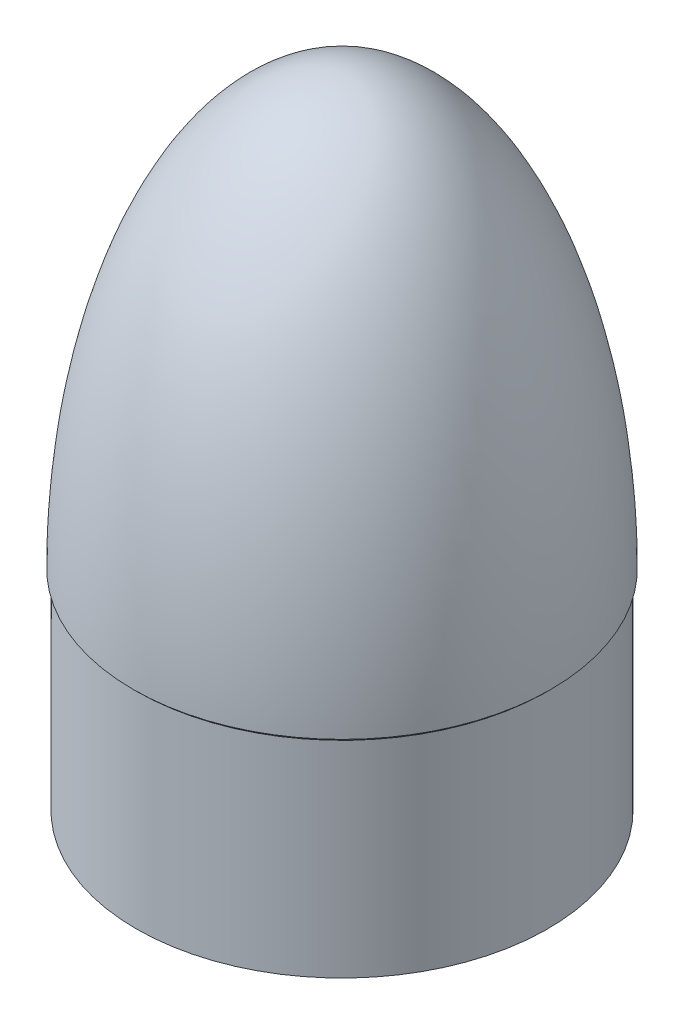
ISO-10303-21;
HEADER;
FILE_DESCRIPTION(('STEP AP214'),'2;1');
FILE_NAME('part.step','',(''),(''),'','','');
FILE_SCHEMA(('AUTOMOTIVE_DESIGN { 1 0 10303 214 1 1 1 1 }'));
ENDSEC;
DATA;
#1=APPLICATION_CONTEXT('core data for automotive mechanical design processes');
#2=APPLICATION_PROTOCOL_DEFINITION('international standard','automotive_design',2000,#1);
#3=PRODUCT_CONTEXT('',#1,'mechanical');
#4=PRODUCT('Part','Part','',(#3));
#5=PRODUCT_RELATED_PRODUCT_CATEGORY('part','',(#4));
#6=PRODUCT_DEFINITION_FORMATION('','',#4);
#7=PRODUCT_DEFINITION_CONTEXT('part definition',#1,'design');
#8=PRODUCT_DEFINITION('design','',#6,#7);
#9=PRODUCT_DEFINITION_SHAPE('','',#8);
#10=(LENGTH_UNIT() NAMED_UNIT(*) SI_UNIT(.MILLI.,.METRE.));
#11=(NAMED_UNIT(*) PLANE_ANGLE_UNIT() SI_UNIT($,.RADIAN.));
#12=(NAMED_UNIT(*) SI_UNIT($,.STERADIAN.) SOLID_ANGLE_UNIT());
#13=UNCERTAINTY_MEASURE_WITH_UNIT(LENGTH_MEASURE(1.E-05),#10,'distance_accuracy_value','');
#14=(GEOMETRIC_REPRESENTATION_CONTEXT(3) GLOBAL_UNCERTAINTY_ASSIGNED_CONTEXT((#13)) GLOBAL_UNIT_ASSIGNED_CONTEXT((#10,
#11,#12)) REPRESENTATION_CONTEXT('',''));
#15=CARTESIAN_POINT('',(0.,0.,0.));
#16=DIRECTION('',(0.,0.,1.));
#17=DIRECTION('',(1.,0.,0.));
#18=AXIS2_PLACEMENT_3D('',#15,#16,#17);
#19=CARTESIAN_POINT('',(0.,0.,0.));
#20=DIRECTION('',(0.,0.,1.));
#21=DIRECTION('',(0.,1.,0.));
#22=AXIS2_PLACEMENT_3D('',#19,#20,#21);
#23=ELLIPSE('',#22,165.1,80.518);
#24=TRIMMED_CURVE('',#23,(PARAMETER_VALUE(3.14159265358979)),
(PARAMETER_VALUE(6.28318530717959)),.T.,.PARAMETER.);
#25=CARTESIAN_POINT('',(0.,165.1,0.));
#26=DIRECTION('',(0.,1.,0.));
#27=AXIS1_PLACEMENT('',#25,#26);
#28=SURFACE_OF_REVOLUTION('',#24,#27);
#29=CARTESIAN_POINT('',(0.,165.1,0.));
#30=VERTEX_POINT('',#29);
#31=VERTEX_LOOP('',#30);
#32=FACE_BOUND('',#31,.T.);
#33=CARTESIAN_POINT('',(0.,0.,0.));
#34=DIRECTION('',(0.,1.,0.));
#35=DIRECTION('',(0.,0.,1.));
#36=AXIS2_PLACEMENT_3D('',#33,#34,#35);
#37=CIRCLE('',#36,80.518);
#38=CARTESIAN_POINT('',(0.,0.,80.518));
#39=VERTEX_POINT('',#38);
#40=EDGE_CURVE('E58',#39,#39,#37,.T.);
#41=ORIENTED_EDGE('',*,*,#40,.T.);
#42=EDGE_LOOP('',(#41));
#43=FACE_BOUND('',#42,.T.);
#44=ADVANCED_FACE('F39',(#32,#43),#28,.T.);
#45=CARTESIAN_POINT('',(0.,0.,0.));
#46=DIRECTION('',(0.,0.,-1.));
#47=DIRECTION('',(0.,1.,0.));
#48=AXIS2_PLACEMENT_3D('',#45,#46,#47);
#49=ELLIPSE('',#48,162.1028,79.318);
#50=TRIMMED_CURVE('',#49,(PARAMETER_VALUE(0.)),(PARAMETER_VALUE(3.14159265358979)),.T.,.PARAMETER.);
#51=CARTESIAN_POINT('',(0.,165.1,0.));
#52=DIRECTION('',(0.,1.,0.));
#53=AXIS1_PLACEMENT('',#51,#52);
#54=SURFACE_OF_REVOLUTION('',#50,#53);
#55=CARTESIAN_POINT('',(0.,1.34286276748669,0.));
#56=DIRECTION('',(0.,1.,0.));
#57=DIRECTION('',(0.,0.,1.));
#58=AXIS2_PLACEMENT_3D('',#55,#56,#57);
#59=CIRCLE('',#58,79.3152783552151);
#60=CARTESIAN_POINT('',(0.,1.34286276748669,79.3152783552151));
#61=VERTEX_POINT('',#60);
#62=EDGE_CURVE('E11',#61,#61,#59,.T.);
#63=ORIENTED_EDGE('',*,*,#62,.F.);
#64=EDGE_LOOP('',(#63));
#65=FACE_BOUND('',#64,.T.);
#66=CARTESIAN_POINT('',(0.,162.1028,0.));
#67=VERTEX_POINT('',#66);
#68=VERTEX_LOOP('',#67);
#69=FACE_BOUND('',#68,.T.);
#70=ADVANCED_FACE('F55',(#65,#69),#54,.T.);
#71=CARTESIAN_POINT('',(0.,1.34286276748669,0.));
#72=DIRECTION('',(0.,1.,0.));
#73=DIRECTION('',(0.,0.,1.));
#74=AXIS2_PLACEMENT_3D('',#71,#72,#73);
#75=CONICAL_SURFACE('',#74,79.3152783552151,0.78539816339744);
#76=CARTESIAN_POINT('',(0.,-0.397415587728406,0.));
#77=DIRECTION('',(0.,1.,0.));
#78=DIRECTION('',(0.,0.,1.));
#79=AXIS2_PLACEMENT_3D('',#76,#77,#78);
#80=CIRCLE('',#79,77.575);
#81=CARTESIAN_POINT('',(0.,-0.397415587728406,77.575));
#82=VERTEX_POINT('',#81);
#83=EDGE_CURVE('E47',#82,#82,#80,.T.);
#84=ORIENTED_EDGE('',*,*,#83,.F.);
#85=EDGE_LOOP('',(#84));
#86=FACE_BOUND('',#85,.T.);
#87=ORIENTED_EDGE('',*,*,#62,.T.);
#88=EDGE_LOOP('',(#87));
#89=FACE_BOUND('',#88,.T.);
#90=ADVANCED_FACE('F77',(#86,#89),#75,.F.);
#91=CARTESIAN_POINT('',(0.,165.1,0.));
#92=DIRECTION('',(0.,1.,0.));
#93=DIRECTION('',(0.,0.,1.));
#94=AXIS2_PLACEMENT_3D('',#91,#92,#93);
#95=CYLINDRICAL_SURFACE('',#94,77.575);
#96=CARTESIAN_POINT('',(0.,-80.518,0.));
#97=DIRECTION('',(0.,1.,0.));
#98=DIRECTION('',(0.,0.,1.));
#99=AXIS2_PLACEMENT_3D('',#96,#97,#98);
#100=CIRCLE('',#99,77.575);
#101=CARTESIAN_POINT('',(0.,-80.518,77.575));
#102=VERTEX_POINT('',#101);
#103=EDGE_CURVE('E70',#102,#102,#100,.T.);
#104=ORIENTED_EDGE('',*,*,#103,.F.);
#105=EDGE_LOOP('',(#104));
#106=FACE_BOUND('',#105,.T.);
#107=ORIENTED_EDGE('',*,*,#83,.T.);
#108=EDGE_LOOP('',(#107));
#109=FACE_BOUND('',#108,.T.);
#110=ADVANCED_FACE('F75',(#106,#109),#95,.F.);
#111=CARTESIAN_POINT('',(77.575,-80.518,0.));
#112=DIRECTION('',(0.,1.,0.));
#113=DIRECTION('',(0.,0.,1.));
#114=AXIS2_PLACEMENT_3D('',#111,#112,#113);
#115=PLANE('',#114);
#116=CARTESIAN_POINT('',(0.,-80.518,0.));
#117=DIRECTION('',(0.,1.,0.));
#118=DIRECTION('',(0.,0.,1.));
#119=AXIS2_PLACEMENT_3D('',#116,#117,#118);
#120=CIRCLE('',#119,79.375);
#121=CARTESIAN_POINT('',(0.,-80.518,79.375));
#122=VERTEX_POINT('',#121);
#123=EDGE_CURVE('E63',#122,#122,#120,.T.);
#124=ORIENTED_EDGE('',*,*,#123,.F.);
#125=EDGE_LOOP('',(#124));
#126=FACE_BOUND('',#125,.T.);
#127=ORIENTED_EDGE('',*,*,#103,.T.);
#128=EDGE_LOOP('',(#127));
#129=FACE_BOUND('',#128,.T.);
#130=ADVANCED_FACE('F89',(#126,#129),#115,.F.);
#131=CARTESIAN_POINT('',(0.,165.1,0.));
#132=DIRECTION('',(0.,1.,0.));
#133=DIRECTION('',(0.,0.,1.));
#134=AXIS2_PLACEMENT_3D('',#131,#132,#133);
#135=CYLINDRICAL_SURFACE('',#134,79.375);
#136=CARTESIAN_POINT('',(0.,-1.14299999999998,0.));
#137=DIRECTION('',(0.,1.,0.));
#138=DIRECTION('',(0.,0.,1.));
#139=AXIS2_PLACEMENT_3D('',#136,#137,#138);
#140=CIRCLE('',#139,79.375);
#141=CARTESIAN_POINT('',(0.,-1.14299999999998,79.375));
#142=VERTEX_POINT('',#141);
#143=EDGE_CURVE('E60',#142,#142,#140,.T.);
#144=ORIENTED_EDGE('',*,*,#143,.F.);
#145=EDGE_LOOP('',(#144));
#146=FACE_BOUND('',#145,.T.);
#147=ORIENTED_EDGE('',*,*,#123,.T.);
#148=EDGE_LOOP('',(#147));
#149=FACE_BOUND('',#148,.T.);
#150=ADVANCED_FACE('F93',(#146,#149),#135,.T.);
#151=CARTESIAN_POINT('',(0.,-1.14299999999998,0.));
#152=DIRECTION('',(0.,1.,0.));
#153=DIRECTION('',(0.,0.,1.));
#154=AXIS2_PLACEMENT_3D('',#151,#152,#153);
#155=CONICAL_SURFACE('',#154,79.375,0.785398163397454);
#156=ORIENTED_EDGE('',*,*,#40,.F.);
#157=EDGE_LOOP('',(#156));
#158=FACE_BOUND('',#157,.T.);
#159=ORIENTED_EDGE('',*,*,#143,.T.);
#160=EDGE_LOOP('',(#159));
#161=FACE_BOUND('',#160,.T.);
#162=ADVANCED_FACE('F97',(#158,#161),#155,.T.);
#163=CLOSED_SHELL('',(#44,#70,#90,#110,#130,#150,#162));
#164=MANIFOLD_SOLID_BREP('B2',#163);
#165=ADVANCED_BREP_SHAPE_REPRESENTATION('',(#18,#164),#14);
#166=SHAPE_DEFINITION_REPRESENTATION(#9,#165);
ENDSEC;
END-ISO-10303-21;
